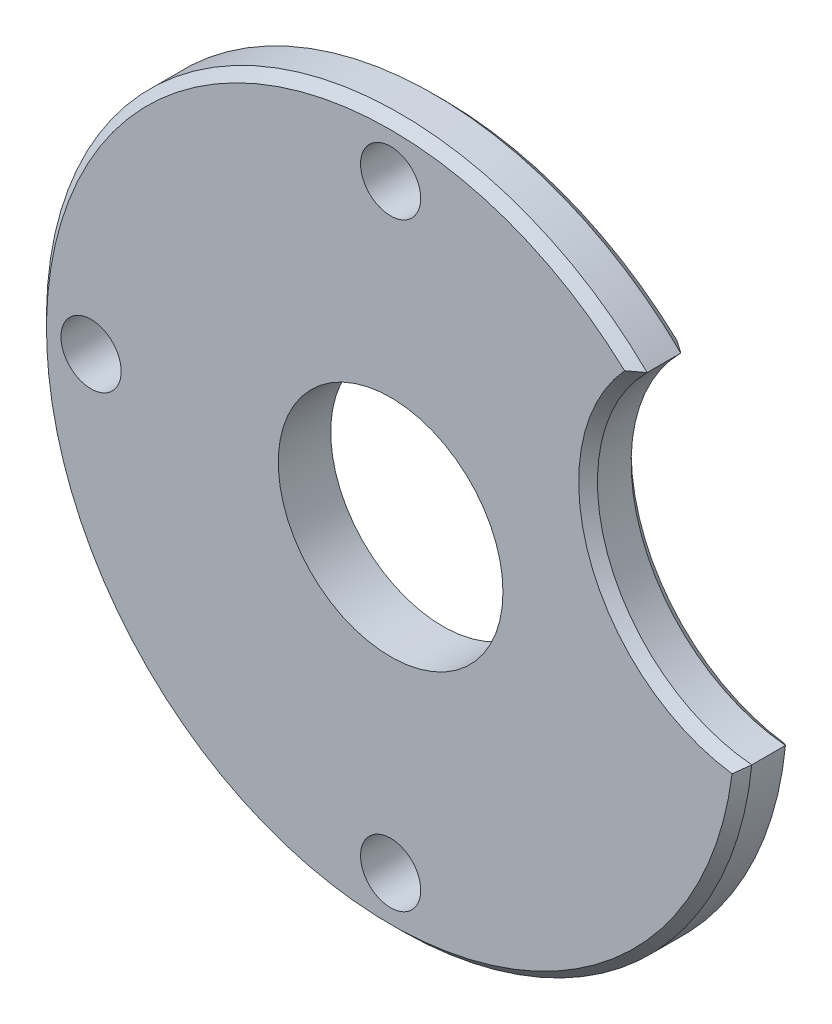
ISO-10303-21;
HEADER;
FILE_DESCRIPTION(('STEP AP214'),'2;1');
FILE_NAME('part.step','',(''),(''),'','','');
FILE_SCHEMA(('AUTOMOTIVE_DESIGN { 1 0 10303 214 1 1 1 1 }'));
ENDSEC;
DATA;
#1=APPLICATION_CONTEXT('core data for automotive mechanical design processes');
#2=APPLICATION_PROTOCOL_DEFINITION('international standard','automotive_design',2000,#1);
#3=PRODUCT_CONTEXT('',#1,'mechanical');
#4=PRODUCT('Part','Part','',(#3));
#5=PRODUCT_RELATED_PRODUCT_CATEGORY('part','',(#4));
#6=PRODUCT_DEFINITION_FORMATION('','',#4);
#7=PRODUCT_DEFINITION_CONTEXT('part definition',#1,'design');
#8=PRODUCT_DEFINITION('design','',#6,#7);
#9=PRODUCT_DEFINITION_SHAPE('','',#8);
#10=(LENGTH_UNIT() NAMED_UNIT(*) SI_UNIT(.MILLI.,.METRE.));
#11=(NAMED_UNIT(*) PLANE_ANGLE_UNIT() SI_UNIT($,.RADIAN.));
#12=(NAMED_UNIT(*) SI_UNIT($,.STERADIAN.) SOLID_ANGLE_UNIT());
#13=UNCERTAINTY_MEASURE_WITH_UNIT(LENGTH_MEASURE(1.E-05),#10,'distance_accuracy_value','');
#14=(GEOMETRIC_REPRESENTATION_CONTEXT(3) GLOBAL_UNCERTAINTY_ASSIGNED_CONTEXT((#13)) GLOBAL_UNIT_ASSIGNED_CONTEXT((#10,
#11,#12)) REPRESENTATION_CONTEXT('',''));
#15=CARTESIAN_POINT('',(0.,0.,0.));
#16=DIRECTION('',(0.,0.,1.));
#17=DIRECTION('',(1.,0.,0.));
#18=AXIS2_PLACEMENT_3D('',#15,#16,#17);
#19=CARTESIAN_POINT('',(31.0286503383507,11.2935051326137,4.445));
#20=DIRECTION('',(0.,0.,-1.));
#21=DIRECTION('',(-1.,0.,0.));
#22=AXIS2_PLACEMENT_3D('',#19,#20,#21);
#23=CYLINDRICAL_SURFACE('',#22,14.2875);
#24=DIRECTION('',(0.,0.,-1.));
#25=VECTOR('',#24,1.);
#26=CARTESIAN_POINT('',(29.8271232178881,-2.94338318010382,4.445));
#27=LINE('',#26,#25);
#28=CARTESIAN_POINT('',(29.8271232178881,-2.94338318010382,3.65125000000001));
#29=VERTEX_POINT('',#28);
#30=CARTESIAN_POINT('',(29.8271232178881,-2.94338318010382,0.793749999999992));
#31=VERTEX_POINT('',#30);
#32=EDGE_CURVE('E95',#29,#31,#27,.T.);
#33=ORIENTED_EDGE('',*,*,#32,.T.);
#34=CARTESIAN_POINT('',(31.0286503383507,11.2935051326137,0.793749999999992));
#35=DIRECTION('',(0.,0.,1.));
#36=DIRECTION('',(1.,0.,0.));
#37=AXIS2_PLACEMENT_3D('',#34,#35,#36);
#38=CIRCLE('',#37,14.2875);
#39=CARTESIAN_POINT('',(20.9569317565576,21.4272675661408,0.793749999999992));
#40=VERTEX_POINT('',#39);
#41=EDGE_CURVE('E59',#31,#40,#38,.F.);
#42=ORIENTED_EDGE('',*,*,#41,.T.);
#43=DIRECTION('',(0.,0.,-1.));
#44=VECTOR('',#43,1.);
#45=CARTESIAN_POINT('',(20.9569317565576,21.4272675661408,4.445));
#46=LINE('',#45,#44);
#47=CARTESIAN_POINT('',(20.9569317565576,21.4272675661408,3.65125000000001));
#48=VERTEX_POINT('',#47);
#49=EDGE_CURVE('E94',#48,#40,#46,.T.);
#50=ORIENTED_EDGE('',*,*,#49,.F.);
#51=CARTESIAN_POINT('',(31.0286503383507,11.2935051326137,3.65125000000001));
#52=DIRECTION('',(0.,0.,1.));
#53=DIRECTION('',(1.,0.,0.));
#54=AXIS2_PLACEMENT_3D('',#51,#52,#53);
#55=CIRCLE('',#54,14.2875);
#56=EDGE_CURVE('E107',#48,#29,#55,.T.);
#57=ORIENTED_EDGE('',*,*,#56,.T.);
#58=EDGE_LOOP('',(#33,#42,#50,#57));
#59=FACE_BOUND('',#58,.T.);
#60=ADVANCED_FACE('F43',(#59),#23,.F.);
#61=CARTESIAN_POINT('',(0.,0.,4.445));
#62=DIRECTION('',(0.,0.,-1.));
#63=DIRECTION('',(-1.,0.,0.));
#64=AXIS2_PLACEMENT_3D('',#61,#62,#63);
#65=CYLINDRICAL_SURFACE('',#64,9.525);
#66=CARTESIAN_POINT('',(0.,0.,4.445));
#67=DIRECTION('',(0.,0.,1.));
#68=DIRECTION('',(1.,0.,0.));
#69=AXIS2_PLACEMENT_3D('',#66,#67,#68);
#70=CIRCLE('',#69,9.525);
#71=CARTESIAN_POINT('',(9.525,0.,4.445));
#72=VERTEX_POINT('',#71);
#73=EDGE_CURVE('E220',#72,#72,#70,.T.);
#74=ORIENTED_EDGE('',*,*,#73,.T.);
#75=EDGE_LOOP('',(#74));
#76=FACE_BOUND('',#75,.T.);
#77=CARTESIAN_POINT('',(0.,0.,0.));
#78=DIRECTION('',(0.,0.,1.));
#79=DIRECTION('',(1.,0.,0.));
#80=AXIS2_PLACEMENT_3D('',#77,#78,#79);
#81=CIRCLE('',#80,9.525);
#82=CARTESIAN_POINT('',(9.525,0.,0.));
#83=VERTEX_POINT('',#82);
#84=EDGE_CURVE('E226',#83,#83,#81,.T.);
#85=ORIENTED_EDGE('',*,*,#84,.F.);
#86=EDGE_LOOP('',(#85));
#87=FACE_BOUND('',#86,.T.);
#88=ADVANCED_FACE('F182',(#76,#87),#65,.F.);
#89=CARTESIAN_POINT('',(0.,25.4,4.445));
#90=DIRECTION('',(0.,0.,-1.));
#91=DIRECTION('',(-1.,0.,0.));
#92=AXIS2_PLACEMENT_3D('',#89,#90,#91);
#93=CYLINDRICAL_SURFACE('',#92,2.5527);
#94=CARTESIAN_POINT('',(0.,25.4,4.445));
#95=DIRECTION('',(0.,0.,1.));
#96=DIRECTION('',(1.,0.,0.));
#97=AXIS2_PLACEMENT_3D('',#94,#95,#96);
#98=CIRCLE('',#97,2.5527);
#99=CARTESIAN_POINT('',(2.5527,25.4,4.445));
#100=VERTEX_POINT('',#99);
#101=EDGE_CURVE('E232',#100,#100,#98,.T.);
#102=ORIENTED_EDGE('',*,*,#101,.T.);
#103=EDGE_LOOP('',(#102));
#104=FACE_BOUND('',#103,.T.);
#105=CARTESIAN_POINT('',(0.,25.4,0.));
#106=DIRECTION('',(0.,0.,1.));
#107=DIRECTION('',(1.,0.,0.));
#108=AXIS2_PLACEMENT_3D('',#105,#106,#107);
#109=CIRCLE('',#108,2.5527);
#110=CARTESIAN_POINT('',(2.5527,25.4,0.));
#111=VERTEX_POINT('',#110);
#112=EDGE_CURVE('E217',#111,#111,#109,.T.);
#113=ORIENTED_EDGE('',*,*,#112,.F.);
#114=EDGE_LOOP('',(#113));
#115=FACE_BOUND('',#114,.T.);
#116=ADVANCED_FACE('F187',(#104,#115),#93,.F.);
#117=CARTESIAN_POINT('',(-25.4,0.,4.445));
#118=DIRECTION('',(0.,0.,-1.));
#119=DIRECTION('',(-1.,0.,0.));
#120=AXIS2_PLACEMENT_3D('',#117,#118,#119);
#121=CYLINDRICAL_SURFACE('',#120,2.5527);
#122=CARTESIAN_POINT('',(-25.4,0.,4.445));
#123=DIRECTION('',(0.,0.,1.));
#124=DIRECTION('',(1.,0.,0.));
#125=AXIS2_PLACEMENT_3D('',#122,#123,#124);
#126=CIRCLE('',#125,2.5527);
#127=CARTESIAN_POINT('',(-22.8473,0.,4.445));
#128=VERTEX_POINT('',#127);
#129=EDGE_CURVE('E236',#128,#128,#126,.T.);
#130=ORIENTED_EDGE('',*,*,#129,.T.);
#131=EDGE_LOOP('',(#130));
#132=FACE_BOUND('',#131,.T.);
#133=CARTESIAN_POINT('',(-25.4,0.,0.));
#134=DIRECTION('',(0.,0.,1.));
#135=DIRECTION('',(1.,0.,0.));
#136=AXIS2_PLACEMENT_3D('',#133,#134,#135);
#137=CIRCLE('',#136,2.5527);
#138=CARTESIAN_POINT('',(-22.8473,0.,0.));
#139=VERTEX_POINT('',#138);
#140=EDGE_CURVE('E213',#139,#139,#137,.T.);
#141=ORIENTED_EDGE('',*,*,#140,.F.);
#142=EDGE_LOOP('',(#141));
#143=FACE_BOUND('',#142,.T.);
#144=ADVANCED_FACE('F195',(#132,#143),#121,.F.);
#145=CARTESIAN_POINT('',(0.,-25.4,4.445));
#146=DIRECTION('',(0.,0.,-1.));
#147=DIRECTION('',(-1.,0.,0.));
#148=AXIS2_PLACEMENT_3D('',#145,#146,#147);
#149=CYLINDRICAL_SURFACE('',#148,2.5527);
#150=CARTESIAN_POINT('',(0.,-25.4,4.445));
#151=DIRECTION('',(0.,0.,1.));
#152=DIRECTION('',(1.,0.,0.));
#153=AXIS2_PLACEMENT_3D('',#150,#151,#152);
#154=CIRCLE('',#153,2.5527);
#155=CARTESIAN_POINT('',(2.5527,-25.4,4.445));
#156=VERTEX_POINT('',#155);
#157=EDGE_CURVE('E209',#156,#156,#154,.T.);
#158=ORIENTED_EDGE('',*,*,#157,.T.);
#159=EDGE_LOOP('',(#158));
#160=FACE_BOUND('',#159,.T.);
#161=CARTESIAN_POINT('',(0.,-25.4,0.));
#162=DIRECTION('',(0.,0.,1.));
#163=DIRECTION('',(1.,0.,0.));
#164=AXIS2_PLACEMENT_3D('',#161,#162,#163);
#165=CIRCLE('',#164,2.5527);
#166=CARTESIAN_POINT('',(2.5527,-25.4,0.));
#167=VERTEX_POINT('',#166);
#168=EDGE_CURVE('E118',#167,#167,#165,.T.);
#169=ORIENTED_EDGE('',*,*,#168,.F.);
#170=EDGE_LOOP('',(#169));
#171=FACE_BOUND('',#170,.T.);
#172=ADVANCED_FACE('F198',(#160,#171),#149,.F.);
#173=CARTESIAN_POINT('',(0.,0.,4.445));
#174=DIRECTION('',(0.,0.,-1.));
#175=DIRECTION('',(-1.,0.,0.));
#176=AXIS2_PLACEMENT_3D('',#173,#174,#175);
#177=CYLINDRICAL_SURFACE('',#176,29.972);
#178=ORIENTED_EDGE('',*,*,#49,.T.);
#179=CARTESIAN_POINT('',(0.,0.,0.793749999999992));
#180=DIRECTION('',(0.,0.,1.));
#181=DIRECTION('',(1.,0.,0.));
#182=AXIS2_PLACEMENT_3D('',#179,#180,#181);
#183=CIRCLE('',#182,29.972);
#184=EDGE_CURVE('E11',#40,#31,#183,.T.);
#185=ORIENTED_EDGE('',*,*,#184,.T.);
#186=ORIENTED_EDGE('',*,*,#32,.F.);
#187=CARTESIAN_POINT('',(0.,0.,3.65125000000001));
#188=DIRECTION('',(0.,0.,1.));
#189=DIRECTION('',(1.,0.,0.));
#190=AXIS2_PLACEMENT_3D('',#187,#188,#189);
#191=CIRCLE('',#190,29.972);
#192=EDGE_CURVE('E91',#29,#48,#191,.F.);
#193=ORIENTED_EDGE('',*,*,#192,.T.);
#194=EDGE_LOOP('',(#178,#185,#186,#193));
#195=FACE_BOUND('',#194,.T.);
#196=ADVANCED_FACE('F93',(#195),#177,.T.);
#197=CARTESIAN_POINT('',(0.,0.,4.445));
#198=DIRECTION('',(0.,0.,1.));
#199=DIRECTION('',(1.,0.,0.));
#200=AXIS2_PLACEMENT_3D('',#197,#198,#199);
#201=PLANE('',#200);
#202=CARTESIAN_POINT('',(0.,0.,4.445));
#203=DIRECTION('',(0.,0.,1.));
#204=DIRECTION('',(1.,0.,0.));
#205=AXIS2_PLACEMENT_3D('',#202,#203,#204);
#206=CIRCLE('',#205,29.17825);
#207=CARTESIAN_POINT('',(19.834682386636,21.3998983101269,4.445));
#208=VERTEX_POINT('',#207);
#209=CARTESIAN_POINT('',(28.9498377056139,-3.64378510358622,4.445));
#210=VERTEX_POINT('',#209);
#211=EDGE_CURVE('E113',#208,#210,#206,.T.);
#212=ORIENTED_EDGE('',*,*,#211,.T.);
#213=CARTESIAN_POINT('',(31.0286503383507,11.2935051326137,4.445));
#214=DIRECTION('',(0.,0.,1.));
#215=DIRECTION('',(1.,0.,0.));
#216=AXIS2_PLACEMENT_3D('',#213,#214,#215);
#217=CIRCLE('',#216,15.08125);
#218=EDGE_CURVE('E102',#210,#208,#217,.F.);
#219=ORIENTED_EDGE('',*,*,#218,.T.);
#220=EDGE_LOOP('',(#212,#219));
#221=FACE_BOUND('',#220,.T.);
#222=ORIENTED_EDGE('',*,*,#157,.F.);
#223=EDGE_LOOP('',(#222));
#224=FACE_BOUND('',#223,.T.);
#225=ORIENTED_EDGE('',*,*,#129,.F.);
#226=EDGE_LOOP('',(#225));
#227=FACE_BOUND('',#226,.T.);
#228=ORIENTED_EDGE('',*,*,#101,.F.);
#229=EDGE_LOOP('',(#228));
#230=FACE_BOUND('',#229,.T.);
#231=ORIENTED_EDGE('',*,*,#73,.F.);
#232=EDGE_LOOP('',(#231));
#233=FACE_BOUND('',#232,.T.);
#234=ADVANCED_FACE('F205',(#221,#224,#227,#230,#233),#201,.T.);
#235=CARTESIAN_POINT('',(0.,0.,0.));
#236=DIRECTION('',(0.,0.,1.));
#237=DIRECTION('',(1.,0.,0.));
#238=AXIS2_PLACEMENT_3D('',#235,#236,#237);
#239=PLANE('',#238);
#240=CARTESIAN_POINT('',(0.,0.,0.));
#241=DIRECTION('',(0.,0.,1.));
#242=DIRECTION('',(1.,0.,0.));
#243=AXIS2_PLACEMENT_3D('',#240,#241,#242);
#244=CIRCLE('',#243,29.17825);
#245=CARTESIAN_POINT('',(28.9498377056139,-3.64378510358621,0.));
#246=VERTEX_POINT('',#245);
#247=CARTESIAN_POINT('',(19.834682386636,21.3998983101269,0.));
#248=VERTEX_POINT('',#247);
#249=EDGE_CURVE('E101',#246,#248,#244,.F.);
#250=ORIENTED_EDGE('',*,*,#249,.T.);
#251=CARTESIAN_POINT('',(31.0286503383507,11.2935051326137,0.));
#252=DIRECTION('',(0.,0.,1.));
#253=DIRECTION('',(1.,0.,0.));
#254=AXIS2_PLACEMENT_3D('',#251,#252,#253);
#255=CIRCLE('',#254,15.08125);
#256=EDGE_CURVE('E168',#248,#246,#255,.T.);
#257=ORIENTED_EDGE('',*,*,#256,.T.);
#258=EDGE_LOOP('',(#250,#257));
#259=FACE_BOUND('',#258,.T.);
#260=ORIENTED_EDGE('',*,*,#168,.T.);
#261=EDGE_LOOP('',(#260));
#262=FACE_BOUND('',#261,.T.);
#263=ORIENTED_EDGE('',*,*,#140,.T.);
#264=EDGE_LOOP('',(#263));
#265=FACE_BOUND('',#264,.T.);
#266=ORIENTED_EDGE('',*,*,#112,.T.);
#267=EDGE_LOOP('',(#266));
#268=FACE_BOUND('',#267,.T.);
#269=ORIENTED_EDGE('',*,*,#84,.T.);
#270=EDGE_LOOP('',(#269));
#271=FACE_BOUND('',#270,.T.);
#272=ADVANCED_FACE('F174',(#259,#262,#265,#268,#271),#239,.F.);
#273=CARTESIAN_POINT('',(0.,0.,4.445));
#274=DIRECTION('',(0.,0.,-1.));
#275=DIRECTION('',(-1.,0.,0.));
#276=AXIS2_PLACEMENT_3D('',#273,#274,#275);
#277=CONICAL_SURFACE('',#276,29.17825,0.785398163397446);
#278=CARTESIAN_POINT('',(29.8271232178881,-2.94338318010382,3.65125000000001));
#279=CARTESIAN_POINT('',(29.68293848519,-3.06333983694007,3.78294124763476));
#280=CARTESIAN_POINT('',(29.5377389112068,-3.18168505480502,3.9149327779453));
#281=CARTESIAN_POINT('',(29.2453104026459,-3.41515235553546,4.17951611260112));
#282=CARTESIAN_POINT('',(29.0980814725377,-3.53027444549798,4.31210791562391));
#283=CARTESIAN_POINT('',(28.9498377056139,-3.64378510358622,4.445));
#284=B_SPLINE_CURVE_WITH_KNOTS('',3,(#278,#279,#280,#281,#282,#283),.UNSPECIFIED.,.F.,.F.,(4,2,
4),(0.,0.687453590107015,1.37490566638793),.UNSPECIFIED.);
#285=EDGE_CURVE('E119',#210,#29,#284,.F.);
#286=ORIENTED_EDGE('',*,*,#285,.F.);
#287=ORIENTED_EDGE('',*,*,#211,.F.);
#288=CARTESIAN_POINT('',(19.834682386636,21.3998983101269,4.445));
#289=CARTESIAN_POINT('',(20.0212069451015,21.4082333578555,4.31210791562391));
#290=CARTESIAN_POINT('',(20.2079899019064,21.4146816526205,4.17951611260112));
#291=CARTESIAN_POINT('',(20.5820730240755,21.423804746268,3.9149327779453));
#292=CARTESIAN_POINT('',(20.7693731905778,21.426479536841,3.78294124763476));
#293=CARTESIAN_POINT('',(20.9569317565576,21.4272675661408,3.65125000000001));
#294=B_SPLINE_CURVE_WITH_KNOTS('',3,(#288,#289,#290,#291,#292,#293),.UNSPECIFIED.,.F.,.F.,(4,2,
4),(0.,0.687452076280909,1.37490566638792),.UNSPECIFIED.);
#295=EDGE_CURVE('E111',#48,#208,#294,.F.);
#296=ORIENTED_EDGE('',*,*,#295,.F.);
#297=ORIENTED_EDGE('',*,*,#192,.F.);
#298=EDGE_LOOP('',(#286,#287,#296,#297));
#299=FACE_BOUND('',#298,.T.);
#300=ADVANCED_FACE('F112',(#299),#277,.T.);
#301=CARTESIAN_POINT('',(31.0286503383507,11.2935051326137,3.65125000000001));
#302=DIRECTION('',(0.,0.,1.));
#303=DIRECTION('',(1.,0.,0.));
#304=AXIS2_PLACEMENT_3D('',#301,#302,#303);
#305=CONICAL_SURFACE('',#304,14.2875,0.785398163397448);
#306=ORIENTED_EDGE('',*,*,#295,.T.);
#307=ORIENTED_EDGE('',*,*,#218,.F.);
#308=ORIENTED_EDGE('',*,*,#285,.T.);
#309=ORIENTED_EDGE('',*,*,#56,.F.);
#310=EDGE_LOOP('',(#306,#307,#308,#309));
#311=FACE_BOUND('',#310,.T.);
#312=ADVANCED_FACE('F121',(#311),#305,.F.);
#313=CARTESIAN_POINT('',(0.,0.,0.793749999999992));
#314=DIRECTION('',(0.,0.,1.));
#315=DIRECTION('',(1.,0.,0.));
#316=AXIS2_PLACEMENT_3D('',#313,#314,#315);
#317=CONICAL_SURFACE('',#316,29.972,0.785398163397446);
#318=CARTESIAN_POINT('',(28.9498377056139,-3.64378510358621,0.));
#319=CARTESIAN_POINT('',(29.0980814725377,-3.53027444549798,0.132892084376086));
#320=CARTESIAN_POINT('',(29.2453104026459,-3.41515235553546,0.265483887398877));
#321=CARTESIAN_POINT('',(29.5377389112068,-3.18168505480502,0.530067222054698));
#322=CARTESIAN_POINT('',(29.68293848519,-3.06333983694007,0.662058752365238));
#323=CARTESIAN_POINT('',(29.8271232178881,-2.94338318010382,0.793749999999992));
#324=B_SPLINE_CURVE_WITH_KNOTS('',3,(#318,#319,#320,#321,#322,#323),.UNSPECIFIED.,.F.,.F.,(4,2,
4),(0.,0.687452076280911,1.37490566638792),.UNSPECIFIED.);
#325=EDGE_CURVE('E159',#31,#246,#324,.F.);
#326=ORIENTED_EDGE('',*,*,#325,.F.);
#327=ORIENTED_EDGE('',*,*,#184,.F.);
#328=CARTESIAN_POINT('',(20.9569317565576,21.4272675661408,0.793749999999992));
#329=CARTESIAN_POINT('',(20.7693731905778,21.426479536841,0.662058752365238));
#330=CARTESIAN_POINT('',(20.5820730240755,21.423804746268,0.530067222054698));
#331=CARTESIAN_POINT('',(20.2079899019064,21.4146816526204,0.265483887398877));
#332=CARTESIAN_POINT('',(20.0212069451015,21.4082333578555,0.132892084376086));
#333=CARTESIAN_POINT('',(19.834682386636,21.3998983101269,0.));
#334=B_SPLINE_CURVE_WITH_KNOTS('',3,(#328,#329,#330,#331,#332,#333),.UNSPECIFIED.,.F.,.F.,(4,2,
4),(0.,0.687453590107011,1.37490566638792),.UNSPECIFIED.);
#335=EDGE_CURVE('E49',#248,#40,#334,.F.);
#336=ORIENTED_EDGE('',*,*,#335,.F.);
#337=ORIENTED_EDGE('',*,*,#249,.F.);
#338=EDGE_LOOP('',(#326,#327,#336,#337));
#339=FACE_BOUND('',#338,.T.);
#340=ADVANCED_FACE('F150',(#339),#317,.T.);
#341=CARTESIAN_POINT('',(31.0286503383507,11.2935051326137,0.));
#342=DIRECTION('',(0.,0.,-1.));
#343=DIRECTION('',(-1.,0.,0.));
#344=AXIS2_PLACEMENT_3D('',#341,#342,#343);
#345=CONICAL_SURFACE('',#344,15.08125,0.785398163397446);
#346=ORIENTED_EDGE('',*,*,#335,.T.);
#347=ORIENTED_EDGE('',*,*,#41,.F.);
#348=ORIENTED_EDGE('',*,*,#325,.T.);
#349=ORIENTED_EDGE('',*,*,#256,.F.);
#350=EDGE_LOOP('',(#346,#347,#348,#349));
#351=FACE_BOUND('',#350,.T.);
#352=ADVANCED_FACE('F46',(#351),#345,.F.);
#353=CLOSED_SHELL('',(#60,#88,#116,#144,#172,#196,#234,#272,#300,#312,#340,#352));
#354=MANIFOLD_SOLID_BREP('B2',#353);
#355=ADVANCED_BREP_SHAPE_REPRESENTATION('',(#18,#354),#14);
#356=SHAPE_DEFINITION_REPRESENTATION(#9,#355);
ENDSEC;
END-ISO-10303-21;
